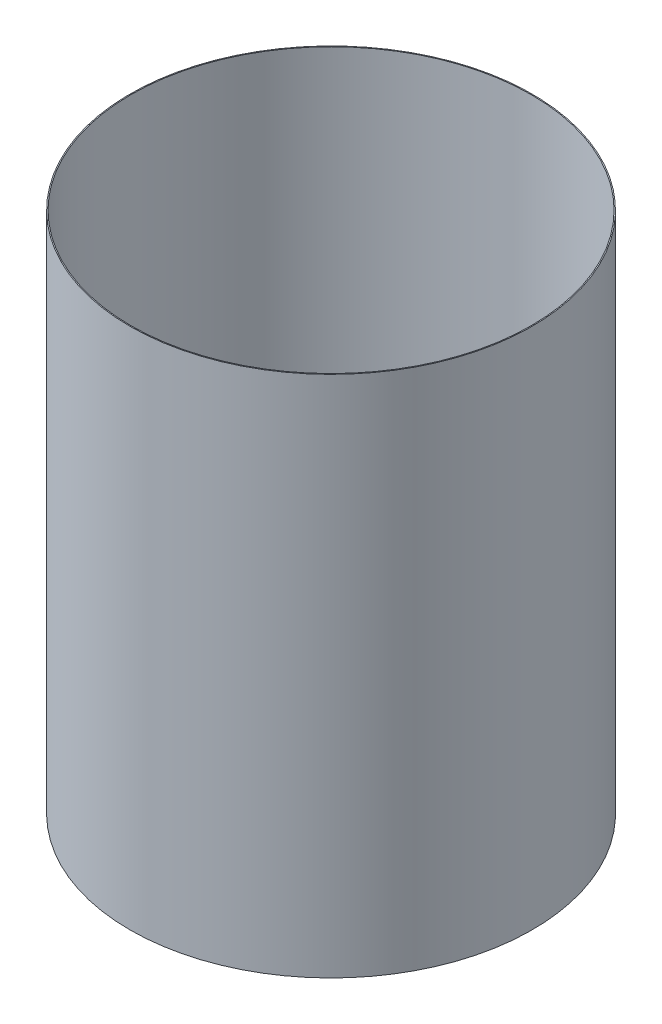
ISO-10303-21;
HEADER;
FILE_DESCRIPTION(('STEP AP214'),'2;1');
FILE_NAME('part.step','',(''),(''),'','','');
FILE_SCHEMA(('AUTOMOTIVE_DESIGN { 1 0 10303 214 1 1 1 1 }'));
ENDSEC;
DATA;
#1=APPLICATION_CONTEXT('core data for automotive mechanical design processes');
#2=APPLICATION_PROTOCOL_DEFINITION('international standard','automotive_design',2000,#1);
#3=PRODUCT_CONTEXT('',#1,'mechanical');
#4=PRODUCT('Part','Part','',(#3));
#5=PRODUCT_RELATED_PRODUCT_CATEGORY('part','',(#4));
#6=PRODUCT_DEFINITION_FORMATION('','',#4);
#7=PRODUCT_DEFINITION_CONTEXT('part definition',#1,'design');
#8=PRODUCT_DEFINITION('design','',#6,#7);
#9=PRODUCT_DEFINITION_SHAPE('','',#8);
#10=(LENGTH_UNIT() NAMED_UNIT(*) SI_UNIT(.MILLI.,.METRE.));
#11=(NAMED_UNIT(*) PLANE_ANGLE_UNIT() SI_UNIT($,.RADIAN.));
#12=(NAMED_UNIT(*) SI_UNIT($,.STERADIAN.) SOLID_ANGLE_UNIT());
#13=UNCERTAINTY_MEASURE_WITH_UNIT(LENGTH_MEASURE(1.E-05),#10,'distance_accuracy_value','');
#14=(GEOMETRIC_REPRESENTATION_CONTEXT(3) GLOBAL_UNCERTAINTY_ASSIGNED_CONTEXT((#13)) GLOBAL_UNIT_ASSIGNED_CONTEXT((#10,
#11,#12)) REPRESENTATION_CONTEXT('',''));
#15=CARTESIAN_POINT('',(0.,0.,0.));
#16=DIRECTION('',(0.,0.,1.));
#17=DIRECTION('',(1.,0.,0.));
#18=AXIS2_PLACEMENT_3D('',#15,#16,#17);
#19=CARTESIAN_POINT('',(0.,55.,0.));
#20=DIRECTION('',(0.,1.,0.));
#21=DIRECTION('',(0.,0.,1.));
#22=AXIS2_PLACEMENT_3D('',#19,#20,#21);
#23=CYLINDRICAL_SURFACE('',#22,51.308);
#24=CARTESIAN_POINT('',(0.,-153.255914232196,0.));
#25=DIRECTION('',(0.,1.,0.));
#26=DIRECTION('',(0.,0.,1.));
#27=AXIS2_PLACEMENT_3D('',#24,#25,#26);
#28=CIRCLE('',#27,51.308);
#29=CARTESIAN_POINT('',(0.,-153.255914232196,51.308));
#30=VERTEX_POINT('',#29);
#31=EDGE_CURVE('E44',#30,#30,#28,.T.);
#32=ORIENTED_EDGE('',*,*,#31,.T.);
#33=EDGE_LOOP('',(#32));
#34=FACE_BOUND('',#33,.T.);
#35=CARTESIAN_POINT('',(0.,-19.905914232196,0.));
#36=DIRECTION('',(0.,1.,0.));
#37=DIRECTION('',(0.,0.,1.));
#38=AXIS2_PLACEMENT_3D('',#35,#36,#37);
#39=CIRCLE('',#38,51.308);
#40=CARTESIAN_POINT('',(0.,-19.905914232196,51.308));
#41=VERTEX_POINT('',#40);
#42=EDGE_CURVE('E10',#41,#41,#39,.T.);
#43=ORIENTED_EDGE('',*,*,#42,.F.);
#44=EDGE_LOOP('',(#43));
#45=FACE_BOUND('',#44,.T.);
#46=ADVANCED_FACE('F30',(#34,#45),#23,.T.);
#47=CARTESIAN_POINT('',(-51.308,-19.905914232196,0.));
#48=DIRECTION('',(0.,-1.,0.));
#49=DIRECTION('',(0.,0.,-1.));
#50=AXIS2_PLACEMENT_3D('',#47,#48,#49);
#51=PLANE('',#50);
#52=CARTESIAN_POINT('',(0.,-19.905914232196,0.));
#53=DIRECTION('',(0.,1.,0.));
#54=DIRECTION('',(0.,0.,1.));
#55=AXIS2_PLACEMENT_3D('',#52,#53,#54);
#56=CIRCLE('',#55,51.054);
#57=CARTESIAN_POINT('',(0.,-19.905914232196,51.054));
#58=VERTEX_POINT('',#57);
#59=EDGE_CURVE('E36',#58,#58,#56,.T.);
#60=ORIENTED_EDGE('',*,*,#59,.F.);
#61=EDGE_LOOP('',(#60));
#62=FACE_BOUND('',#61,.T.);
#63=ORIENTED_EDGE('',*,*,#42,.T.);
#64=EDGE_LOOP('',(#63));
#65=FACE_BOUND('',#64,.T.);
#66=ADVANCED_FACE('F60',(#62,#65),#51,.F.);
#67=CARTESIAN_POINT('',(0.,55.,0.));
#68=DIRECTION('',(0.,1.,0.));
#69=DIRECTION('',(0.,0.,1.));
#70=AXIS2_PLACEMENT_3D('',#67,#68,#69);
#71=CYLINDRICAL_SURFACE('',#70,51.054);
#72=CARTESIAN_POINT('',(0.,-153.255914232196,0.));
#73=DIRECTION('',(0.,1.,0.));
#74=DIRECTION('',(0.,0.,1.));
#75=AXIS2_PLACEMENT_3D('',#72,#73,#74);
#76=CIRCLE('',#75,51.054);
#77=CARTESIAN_POINT('',(0.,-153.255914232196,51.054));
#78=VERTEX_POINT('',#77);
#79=EDGE_CURVE('E40',#78,#78,#76,.T.);
#80=ORIENTED_EDGE('',*,*,#79,.F.);
#81=EDGE_LOOP('',(#80));
#82=FACE_BOUND('',#81,.T.);
#83=ORIENTED_EDGE('',*,*,#59,.T.);
#84=EDGE_LOOP('',(#83));
#85=FACE_BOUND('',#84,.T.);
#86=ADVANCED_FACE('F55',(#82,#85),#71,.F.);
#87=CARTESIAN_POINT('',(-51.054,-153.255914232196,0.));
#88=DIRECTION('',(0.,1.,0.));
#89=DIRECTION('',(0.,0.,1.));
#90=AXIS2_PLACEMENT_3D('',#87,#88,#89);
#91=PLANE('',#90);
#92=ORIENTED_EDGE('',*,*,#31,.F.);
#93=EDGE_LOOP('',(#92));
#94=FACE_BOUND('',#93,.T.);
#95=ORIENTED_EDGE('',*,*,#79,.T.);
#96=EDGE_LOOP('',(#95));
#97=FACE_BOUND('',#96,.T.);
#98=ADVANCED_FACE('F52',(#94,#97),#91,.F.);
#99=CLOSED_SHELL('',(#46,#66,#86,#98));
#100=MANIFOLD_SOLID_BREP('B2',#99);
#101=ADVANCED_BREP_SHAPE_REPRESENTATION('',(#18,#100),#14);
#102=SHAPE_DEFINITION_REPRESENTATION(#9,#101);
ENDSEC;
END-ISO-10303-21;
